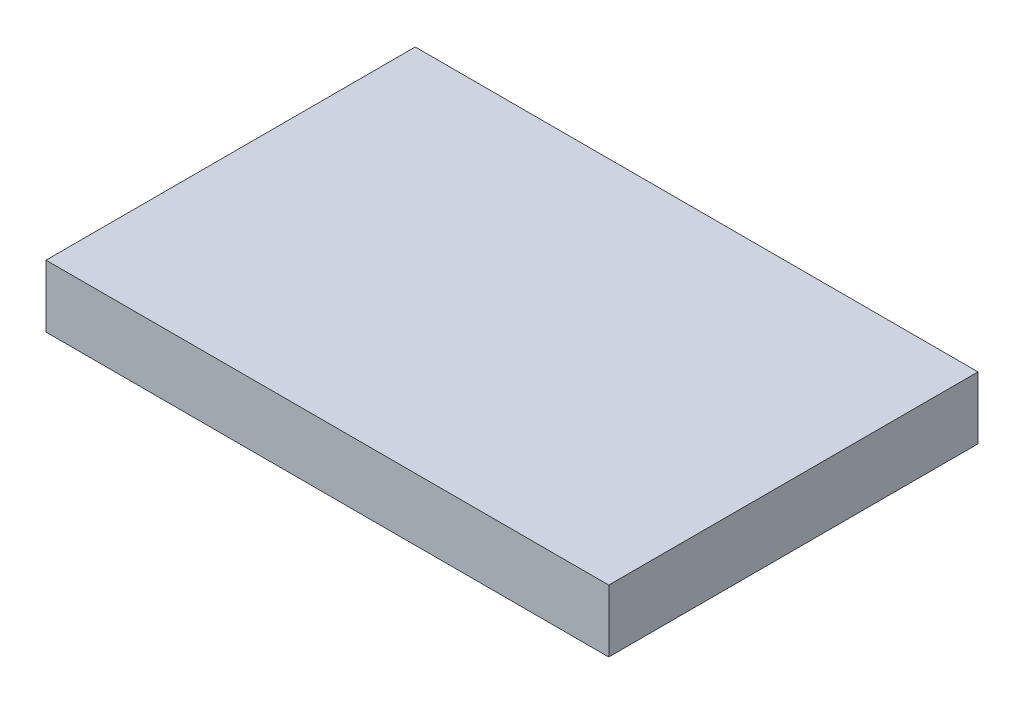
ISO-10303-21;
HEADER;
FILE_DESCRIPTION(('STEP AP214'),'2;1');
FILE_NAME('part.step','',(''),(''),'','','');
FILE_SCHEMA(('AUTOMOTIVE_DESIGN { 1 0 10303 214 1 1 1 1 }'));
ENDSEC;
DATA;
#1=APPLICATION_CONTEXT('core data for automotive mechanical design processes');
#2=APPLICATION_PROTOCOL_DEFINITION('international standard','automotive_design',2000,#1);
#3=PRODUCT_CONTEXT('',#1,'mechanical');
#4=PRODUCT('Part','Part','',(#3));
#5=PRODUCT_RELATED_PRODUCT_CATEGORY('part','',(#4));
#6=PRODUCT_DEFINITION_FORMATION('','',#4);
#7=PRODUCT_DEFINITION_CONTEXT('part definition',#1,'design');
#8=PRODUCT_DEFINITION('design','',#6,#7);
#9=PRODUCT_DEFINITION_SHAPE('','',#8);
#10=(LENGTH_UNIT() NAMED_UNIT(*) SI_UNIT(.MILLI.,.METRE.));
#11=(NAMED_UNIT(*) PLANE_ANGLE_UNIT() SI_UNIT($,.RADIAN.));
#12=(NAMED_UNIT(*) SI_UNIT($,.STERADIAN.) SOLID_ANGLE_UNIT());
#13=UNCERTAINTY_MEASURE_WITH_UNIT(LENGTH_MEASURE(1.E-05),#10,'distance_accuracy_value','');
#14=(GEOMETRIC_REPRESENTATION_CONTEXT(3) GLOBAL_UNCERTAINTY_ASSIGNED_CONTEXT((#13)) GLOBAL_UNIT_ASSIGNED_CONTEXT((#10,
#11,#12)) REPRESENTATION_CONTEXT('',''));
#15=CARTESIAN_POINT('',(0.,0.,0.));
#16=DIRECTION('',(0.,0.,1.));
#17=DIRECTION('',(1.,0.,0.));
#18=AXIS2_PLACEMENT_3D('',#15,#16,#17);
#19=CARTESIAN_POINT('',(40.64,9.,26.665));
#20=DIRECTION('',(-1.,0.,0.));
#21=DIRECTION('',(0.,0.,1.));
#22=AXIS2_PLACEMENT_3D('',#19,#20,#21);
#23=PLANE('',#22);
#24=DIRECTION('',(0.,0.,-1.));
#25=VECTOR('',#24,1.);
#26=CARTESIAN_POINT('',(40.64,0.,26.665));
#27=LINE('',#26,#25);
#28=CARTESIAN_POINT('',(40.64,0.,26.665));
#29=VERTEX_POINT('',#28);
#30=CARTESIAN_POINT('',(40.64,0.,-26.665));
#31=VERTEX_POINT('',#30);
#32=EDGE_CURVE('E107',#29,#31,#27,.T.);
#33=ORIENTED_EDGE('',*,*,#32,.T.);
#34=DIRECTION('',(0.,-1.,0.));
#35=VECTOR('',#34,1.);
#36=CARTESIAN_POINT('',(40.64,9.,-26.665));
#37=LINE('',#36,#35);
#38=CARTESIAN_POINT('',(40.64,9.,-26.665));
#39=VERTEX_POINT('',#38);
#40=EDGE_CURVE('E11',#39,#31,#37,.T.);
#41=ORIENTED_EDGE('',*,*,#40,.F.);
#42=DIRECTION('',(0.,0.,-1.));
#43=VECTOR('',#42,1.);
#44=CARTESIAN_POINT('',(40.64,9.,26.665));
#45=LINE('',#44,#43);
#46=CARTESIAN_POINT('',(40.64,9.,26.665));
#47=VERTEX_POINT('',#46);
#48=EDGE_CURVE('E91',#47,#39,#45,.T.);
#49=ORIENTED_EDGE('',*,*,#48,.F.);
#50=DIRECTION('',(0.,-1.,0.));
#51=VECTOR('',#50,1.);
#52=CARTESIAN_POINT('',(40.64,9.,26.665));
#53=LINE('',#52,#51);
#54=EDGE_CURVE('E103',#47,#29,#53,.T.);
#55=ORIENTED_EDGE('',*,*,#54,.T.);
#56=EDGE_LOOP('',(#33,#41,#49,#55));
#57=FACE_BOUND('',#56,.T.);
#58=ADVANCED_FACE('F39',(#57),#23,.F.);
#59=CARTESIAN_POINT('',(-40.64,9.,-26.665));
#60=DIRECTION('',(0.,0.,1.));
#61=DIRECTION('',(1.,0.,0.));
#62=AXIS2_PLACEMENT_3D('',#59,#60,#61);
#63=PLANE('',#62);
#64=DIRECTION('',(-1.,0.,0.));
#65=VECTOR('',#64,1.);
#66=CARTESIAN_POINT('',(-40.64,0.,-26.665));
#67=LINE('',#66,#65);
#68=CARTESIAN_POINT('',(-40.64,0.,-26.665));
#69=VERTEX_POINT('',#68);
#70=EDGE_CURVE('E96',#31,#69,#67,.T.);
#71=ORIENTED_EDGE('',*,*,#70,.T.);
#72=DIRECTION('',(0.,-1.,0.));
#73=VECTOR('',#72,1.);
#74=CARTESIAN_POINT('',(-40.64,9.,-26.665));
#75=LINE('',#74,#73);
#76=CARTESIAN_POINT('',(-40.64,9.,-26.665));
#77=VERTEX_POINT('',#76);
#78=EDGE_CURVE('E48',#77,#69,#75,.T.);
#79=ORIENTED_EDGE('',*,*,#78,.F.);
#80=DIRECTION('',(-1.,0.,0.));
#81=VECTOR('',#80,1.);
#82=CARTESIAN_POINT('',(-40.64,9.,-26.665));
#83=LINE('',#82,#81);
#84=EDGE_CURVE('E86',#39,#77,#83,.T.);
#85=ORIENTED_EDGE('',*,*,#84,.F.);
#86=ORIENTED_EDGE('',*,*,#40,.T.);
#87=EDGE_LOOP('',(#71,#79,#85,#86));
#88=FACE_BOUND('',#87,.T.);
#89=ADVANCED_FACE('F95',(#88),#63,.F.);
#90=CARTESIAN_POINT('',(-40.64,9.,26.665));
#91=DIRECTION('',(1.,0.,0.));
#92=DIRECTION('',(0.,0.,-1.));
#93=AXIS2_PLACEMENT_3D('',#90,#91,#92);
#94=PLANE('',#93);
#95=DIRECTION('',(0.,0.,1.));
#96=VECTOR('',#95,1.);
#97=CARTESIAN_POINT('',(-40.64,0.,26.665));
#98=LINE('',#97,#96);
#99=CARTESIAN_POINT('',(-40.64,0.,26.665));
#100=VERTEX_POINT('',#99);
#101=EDGE_CURVE('E73',#69,#100,#98,.T.);
#102=ORIENTED_EDGE('',*,*,#101,.T.);
#103=DIRECTION('',(0.,-1.,0.));
#104=VECTOR('',#103,1.);
#105=CARTESIAN_POINT('',(-40.64,9.,26.665));
#106=LINE('',#105,#104);
#107=CARTESIAN_POINT('',(-40.64,9.,26.665));
#108=VERTEX_POINT('',#107);
#109=EDGE_CURVE('E98',#108,#100,#106,.T.);
#110=ORIENTED_EDGE('',*,*,#109,.F.);
#111=DIRECTION('',(0.,0.,1.));
#112=VECTOR('',#111,1.);
#113=CARTESIAN_POINT('',(-40.64,9.,26.665));
#114=LINE('',#113,#112);
#115=EDGE_CURVE('E89',#77,#108,#114,.T.);
#116=ORIENTED_EDGE('',*,*,#115,.F.);
#117=ORIENTED_EDGE('',*,*,#78,.T.);
#118=EDGE_LOOP('',(#102,#110,#116,#117));
#119=FACE_BOUND('',#118,.T.);
#120=ADVANCED_FACE('F99',(#119),#94,.F.);
#121=CARTESIAN_POINT('',(-40.64,9.,26.665));
#122=DIRECTION('',(0.,0.,-1.));
#123=DIRECTION('',(-1.,0.,0.));
#124=AXIS2_PLACEMENT_3D('',#121,#122,#123);
#125=PLANE('',#124);
#126=DIRECTION('',(1.,0.,0.));
#127=VECTOR('',#126,1.);
#128=CARTESIAN_POINT('',(-40.64,0.,26.665));
#129=LINE('',#128,#127);
#130=EDGE_CURVE('E79',#100,#29,#129,.T.);
#131=ORIENTED_EDGE('',*,*,#130,.T.);
#132=ORIENTED_EDGE('',*,*,#54,.F.);
#133=DIRECTION('',(1.,0.,0.));
#134=VECTOR('',#133,1.);
#135=CARTESIAN_POINT('',(-40.64,9.,26.665));
#136=LINE('',#135,#134);
#137=EDGE_CURVE('E56',#108,#47,#136,.T.);
#138=ORIENTED_EDGE('',*,*,#137,.F.);
#139=ORIENTED_EDGE('',*,*,#109,.T.);
#140=EDGE_LOOP('',(#131,#132,#138,#139));
#141=FACE_BOUND('',#140,.T.);
#142=ADVANCED_FACE('F120',(#141),#125,.F.);
#143=CARTESIAN_POINT('',(0.,9.,0.));
#144=DIRECTION('',(0.,-1.,0.));
#145=DIRECTION('',(0.,0.,-1.));
#146=AXIS2_PLACEMENT_3D('',#143,#144,#145);
#147=PLANE('',#146);
#148=ORIENTED_EDGE('',*,*,#48,.T.);
#149=ORIENTED_EDGE('',*,*,#84,.T.);
#150=ORIENTED_EDGE('',*,*,#115,.T.);
#151=ORIENTED_EDGE('',*,*,#137,.T.);
#152=EDGE_LOOP('',(#148,#149,#150,#151));
#153=FACE_BOUND('',#152,.T.);
#154=ADVANCED_FACE('F87',(#153),#147,.F.);
#155=CARTESIAN_POINT('',(0.,0.,0.));
#156=DIRECTION('',(0.,-1.,0.));
#157=DIRECTION('',(0.,0.,-1.));
#158=AXIS2_PLACEMENT_3D('',#155,#156,#157);
#159=PLANE('',#158);
#160=ORIENTED_EDGE('',*,*,#32,.F.);
#161=ORIENTED_EDGE('',*,*,#130,.F.);
#162=ORIENTED_EDGE('',*,*,#101,.F.);
#163=ORIENTED_EDGE('',*,*,#70,.F.);
#164=EDGE_LOOP('',(#160,#161,#162,#163));
#165=FACE_BOUND('',#164,.T.);
#166=ADVANCED_FACE('F123',(#165),#159,.T.);
#167=CLOSED_SHELL('',(#58,#89,#120,#142,#154,#166));
#168=MANIFOLD_SOLID_BREP('B2',#167);
#169=ADVANCED_BREP_SHAPE_REPRESENTATION('',(#18,#168),#14);
#170=SHAPE_DEFINITION_REPRESENTATION(#9,#169);
ENDSEC;
END-ISO-10303-21;
